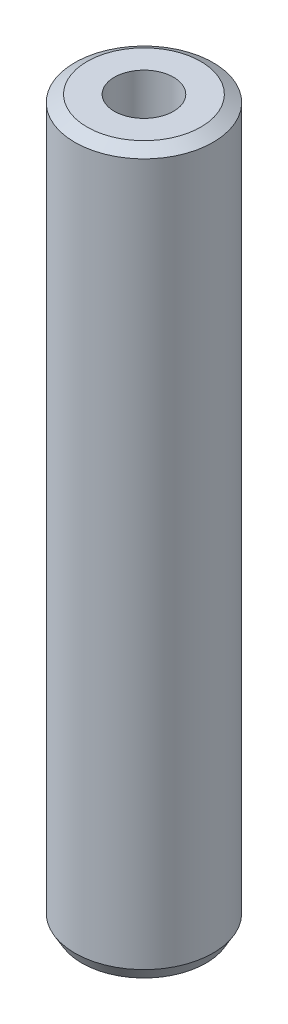
ISO-10303-21;
HEADER;
FILE_DESCRIPTION(('STEP AP214'),'2;1');
FILE_NAME('part.step','',(''),(''),'','','');
FILE_SCHEMA(('AUTOMOTIVE_DESIGN { 1 0 10303 214 1 1 1 1 }'));
ENDSEC;
DATA;
#1=APPLICATION_CONTEXT('core data for automotive mechanical design processes');
#2=APPLICATION_PROTOCOL_DEFINITION('international standard','automotive_design',2000,#1);
#3=PRODUCT_CONTEXT('',#1,'mechanical');
#4=PRODUCT('Part','Part','',(#3));
#5=PRODUCT_RELATED_PRODUCT_CATEGORY('part','',(#4));
#6=PRODUCT_DEFINITION_FORMATION('','',#4);
#7=PRODUCT_DEFINITION_CONTEXT('part definition',#1,'design');
#8=PRODUCT_DEFINITION('design','',#6,#7);
#9=PRODUCT_DEFINITION_SHAPE('','',#8);
#10=(LENGTH_UNIT() NAMED_UNIT(*) SI_UNIT(.MILLI.,.METRE.));
#11=(NAMED_UNIT(*) PLANE_ANGLE_UNIT() SI_UNIT($,.RADIAN.));
#12=(NAMED_UNIT(*) SI_UNIT($,.STERADIAN.) SOLID_ANGLE_UNIT());
#13=UNCERTAINTY_MEASURE_WITH_UNIT(LENGTH_MEASURE(1.E-05),#10,'distance_accuracy_value','');
#14=(GEOMETRIC_REPRESENTATION_CONTEXT(3) GLOBAL_UNCERTAINTY_ASSIGNED_CONTEXT((#13)) GLOBAL_UNIT_ASSIGNED_CONTEXT((#10,
#11,#12)) REPRESENTATION_CONTEXT('',''));
#15=CARTESIAN_POINT('',(0.,0.,0.));
#16=DIRECTION('',(0.,0.,1.));
#17=DIRECTION('',(1.,0.,0.));
#18=AXIS2_PLACEMENT_3D('',#15,#16,#17);
#19=CARTESIAN_POINT('',(0.,600.,0.));
#20=DIRECTION('',(0.,-1.,0.));
#21=DIRECTION('',(0.,0.,-1.));
#22=AXIS2_PLACEMENT_3D('',#19,#20,#21);
#23=CYLINDRICAL_SURFACE('',#22,57.5);
#24=CARTESIAN_POINT('',(0.,594.105251445164,0.));
#25=DIRECTION('',(0.,1.,0.));
#26=DIRECTION('',(0.,0.,1.));
#27=AXIS2_PLACEMENT_3D('',#24,#25,#26);
#28=CIRCLE('',#27,57.5);
#29=CARTESIAN_POINT('',(0.,594.105251445164,57.5));
#30=VERTEX_POINT('',#29);
#31=EDGE_CURVE('E50',#30,#30,#28,.F.);
#32=ORIENTED_EDGE('',*,*,#31,.T.);
#33=EDGE_LOOP('',(#32));
#34=FACE_BOUND('',#33,.T.);
#35=CARTESIAN_POINT('',(0.,10.2100039948193,0.));
#36=DIRECTION('',(0.,1.,0.));
#37=DIRECTION('',(0.,0.,1.));
#38=AXIS2_PLACEMENT_3D('',#35,#36,#37);
#39=CIRCLE('',#38,57.5);
#40=CARTESIAN_POINT('',(0.,10.2100039948193,57.5));
#41=VERTEX_POINT('',#40);
#42=EDGE_CURVE('E51',#41,#41,#39,.T.);
#43=ORIENTED_EDGE('',*,*,#42,.T.);
#44=EDGE_LOOP('',(#43));
#45=FACE_BOUND('',#44,.T.);
#46=ADVANCED_FACE('F39',(#34,#45),#23,.T.);
#47=CARTESIAN_POINT('',(0.,600.,0.));
#48=DIRECTION('',(0.,1.,0.));
#49=DIRECTION('',(0.,0.,1.));
#50=AXIS2_PLACEMENT_3D('',#47,#48,#49);
#51=PLANE('',#50);
#52=CARTESIAN_POINT('',(0.,600.,0.));
#53=DIRECTION('',(0.,1.,0.));
#54=DIRECTION('',(0.,0.,1.));
#55=AXIS2_PLACEMENT_3D('',#52,#53,#54);
#56=CIRCLE('',#55,47.2899960051805);
#57=CARTESIAN_POINT('',(0.,600.,47.2899960051805));
#58=VERTEX_POINT('',#57);
#59=EDGE_CURVE('E54',#58,#58,#56,.T.);
#60=ORIENTED_EDGE('',*,*,#59,.T.);
#61=EDGE_LOOP('',(#60));
#62=FACE_BOUND('',#61,.T.);
#63=CARTESIAN_POINT('',(0.,600.,0.));
#64=DIRECTION('',(0.,1.,0.));
#65=DIRECTION('',(0.,0.,1.));
#66=AXIS2_PLACEMENT_3D('',#63,#64,#65);
#67=CIRCLE('',#66,24.6047307911351);
#68=CARTESIAN_POINT('',(0.,600.,24.6047307911351));
#69=VERTEX_POINT('',#68);
#70=EDGE_CURVE('E58',#69,#69,#67,.T.);
#71=ORIENTED_EDGE('',*,*,#70,.F.);
#72=EDGE_LOOP('',(#71));
#73=FACE_BOUND('',#72,.T.);
#74=ADVANCED_FACE('F69',(#62,#73),#51,.T.);
#75=CARTESIAN_POINT('',(0.,0.,0.));
#76=DIRECTION('',(0.,1.,0.));
#77=DIRECTION('',(0.,0.,1.));
#78=AXIS2_PLACEMENT_3D('',#75,#76,#77);
#79=PLANE('',#78);
#80=CARTESIAN_POINT('',(0.,0.,0.));
#81=DIRECTION('',(0.,1.,0.));
#82=DIRECTION('',(0.,0.,1.));
#83=AXIS2_PLACEMENT_3D('',#80,#81,#82);
#84=CIRCLE('',#83,51.6052514451639);
#85=CARTESIAN_POINT('',(0.,0.,51.6052514451639));
#86=VERTEX_POINT('',#85);
#87=EDGE_CURVE('E10',#86,#86,#84,.F.);
#88=ORIENTED_EDGE('',*,*,#87,.T.);
#89=EDGE_LOOP('',(#88));
#90=FACE_BOUND('',#89,.T.);
#91=CARTESIAN_POINT('',(0.,0.,0.));
#92=DIRECTION('',(0.,1.,0.));
#93=DIRECTION('',(0.,0.,1.));
#94=AXIS2_PLACEMENT_3D('',#91,#92,#93);
#95=CIRCLE('',#94,24.6047307911351);
#96=CARTESIAN_POINT('',(0.,0.,24.6047307911351));
#97=VERTEX_POINT('',#96);
#98=EDGE_CURVE('E63',#97,#97,#95,.T.);
#99=ORIENTED_EDGE('',*,*,#98,.T.);
#100=EDGE_LOOP('',(#99));
#101=FACE_BOUND('',#100,.T.);
#102=ADVANCED_FACE('F75',(#90,#101),#79,.F.);
#103=CARTESIAN_POINT('',(0.,600.,0.));
#104=DIRECTION('',(0.,-1.,0.));
#105=DIRECTION('',(0.,0.,-1.));
#106=AXIS2_PLACEMENT_3D('',#103,#104,#105);
#107=CYLINDRICAL_SURFACE('',#106,24.6047307911351);
#108=ORIENTED_EDGE('',*,*,#70,.T.);
#109=EDGE_LOOP('',(#108));
#110=FACE_BOUND('',#109,.T.);
#111=ORIENTED_EDGE('',*,*,#98,.F.);
#112=EDGE_LOOP('',(#111));
#113=FACE_BOUND('',#112,.T.);
#114=ADVANCED_FACE('F70',(#110,#113),#107,.F.);
#115=CARTESIAN_POINT('',(0.,600.,0.));
#116=DIRECTION('',(0.,-1.,0.));
#117=DIRECTION('',(0.,0.,-1.));
#118=AXIS2_PLACEMENT_3D('',#115,#116,#117);
#119=CONICAL_SURFACE('',#118,47.2899960051805,1.04719755119659);
#120=ORIENTED_EDGE('',*,*,#31,.F.);
#121=EDGE_LOOP('',(#120));
#122=FACE_BOUND('',#121,.T.);
#123=ORIENTED_EDGE('',*,*,#59,.F.);
#124=EDGE_LOOP('',(#123));
#125=FACE_BOUND('',#124,.T.);
#126=ADVANCED_FACE('F81',(#122,#125),#119,.T.);
#127=CARTESIAN_POINT('',(0.,10.2100039948193,0.));
#128=DIRECTION('',(0.,1.,0.));
#129=DIRECTION('',(0.,0.,1.));
#130=AXIS2_PLACEMENT_3D('',#127,#128,#129);
#131=CONICAL_SURFACE('',#130,57.5,0.523598775598303);
#132=ORIENTED_EDGE('',*,*,#87,.F.);
#133=EDGE_LOOP('',(#132));
#134=FACE_BOUND('',#133,.T.);
#135=ORIENTED_EDGE('',*,*,#42,.F.);
#136=EDGE_LOOP('',(#135));
#137=FACE_BOUND('',#136,.T.);
#138=ADVANCED_FACE('F45',(#134,#137),#131,.T.);
#139=CLOSED_SHELL('',(#46,#74,#102,#114,#126,#138));
#140=MANIFOLD_SOLID_BREP('B2',#139);
#141=ADVANCED_BREP_SHAPE_REPRESENTATION('',(#18,#140),#14);
#142=SHAPE_DEFINITION_REPRESENTATION(#9,#141);
ENDSEC;
END-ISO-10303-21;
